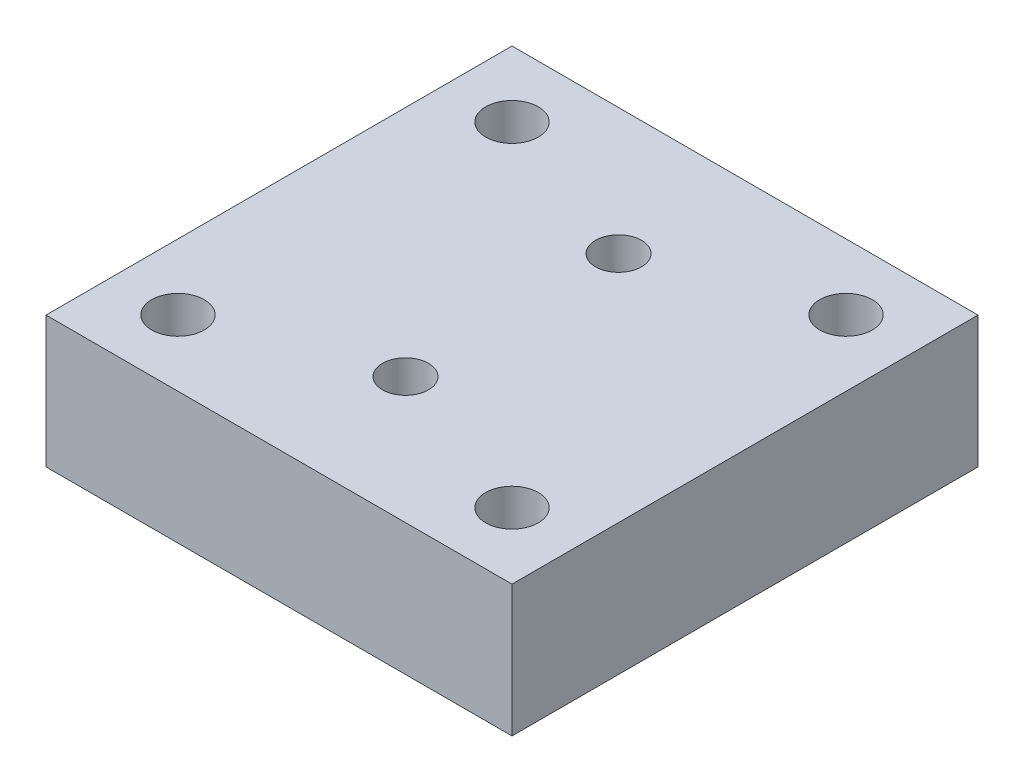
ISO-10303-21;
HEADER;
FILE_DESCRIPTION(('STEP AP214'),'2;1');
FILE_NAME('part.step','',(''),(''),'','','');
FILE_SCHEMA(('AUTOMOTIVE_DESIGN { 1 0 10303 214 1 1 1 1 }'));
ENDSEC;
DATA;
#1=APPLICATION_CONTEXT('core data for automotive mechanical design processes');
#2=APPLICATION_PROTOCOL_DEFINITION('international standard','automotive_design',2000,#1);
#3=PRODUCT_CONTEXT('',#1,'mechanical');
#4=PRODUCT('Part','Part','',(#3));
#5=PRODUCT_RELATED_PRODUCT_CATEGORY('part','',(#4));
#6=PRODUCT_DEFINITION_FORMATION('','',#4);
#7=PRODUCT_DEFINITION_CONTEXT('part definition',#1,'design');
#8=PRODUCT_DEFINITION('design','',#6,#7);
#9=PRODUCT_DEFINITION_SHAPE('','',#8);
#10=(LENGTH_UNIT() NAMED_UNIT(*) SI_UNIT(.MILLI.,.METRE.));
#11=(NAMED_UNIT(*) PLANE_ANGLE_UNIT() SI_UNIT($,.RADIAN.));
#12=(NAMED_UNIT(*) SI_UNIT($,.STERADIAN.) SOLID_ANGLE_UNIT());
#13=UNCERTAINTY_MEASURE_WITH_UNIT(LENGTH_MEASURE(1.E-05),#10,'distance_accuracy_value','');
#14=(GEOMETRIC_REPRESENTATION_CONTEXT(3) GLOBAL_UNCERTAINTY_ASSIGNED_CONTEXT((#13)) GLOBAL_UNIT_ASSIGNED_CONTEXT((#10,
#11,#12)) REPRESENTATION_CONTEXT('',''));
#15=CARTESIAN_POINT('',(0.,0.,0.));
#16=DIRECTION('',(0.,0.,1.));
#17=DIRECTION('',(1.,0.,0.));
#18=AXIS2_PLACEMENT_3D('',#15,#16,#17);
#19=CARTESIAN_POINT('',(0.,0.,20.574));
#20=DIRECTION('',(0.,1.,0.));
#21=DIRECTION('',(0.,0.,1.));
#22=AXIS2_PLACEMENT_3D('',#19,#20,#21);
#23=CYLINDRICAL_SURFACE('',#22,4.445);
#24=CARTESIAN_POINT('',(0.,25.4,20.574));
#25=DIRECTION('',(0.,1.,0.));
#26=DIRECTION('',(0.,0.,1.));
#27=AXIS2_PLACEMENT_3D('',#24,#25,#26);
#28=CIRCLE('',#27,4.445);
#29=CARTESIAN_POINT('',(0.,25.4,25.019));
#30=VERTEX_POINT('',#29);
#31=EDGE_CURVE('E130',#30,#30,#28,.T.);
#32=ORIENTED_EDGE('',*,*,#31,.T.);
#33=EDGE_LOOP('',(#32));
#34=FACE_BOUND('',#33,.T.);
#35=CARTESIAN_POINT('',(0.,7.62,20.574));
#36=DIRECTION('',(0.,-1.,0.));
#37=DIRECTION('',(0.,0.,-1.));
#38=AXIS2_PLACEMENT_3D('',#35,#36,#37);
#39=CIRCLE('',#38,4.445);
#40=CARTESIAN_POINT('',(0.,7.62,16.129));
#41=VERTEX_POINT('',#40);
#42=EDGE_CURVE('E37',#41,#41,#39,.F.);
#43=ORIENTED_EDGE('',*,*,#42,.F.);
#44=EDGE_LOOP('',(#43));
#45=FACE_BOUND('',#44,.T.);
#46=ADVANCED_FACE('F33',(#34,#45),#23,.F.);
#47=CARTESIAN_POINT('',(0.,0.,-20.574));
#48=DIRECTION('',(0.,1.,0.));
#49=DIRECTION('',(0.,0.,1.));
#50=AXIS2_PLACEMENT_3D('',#47,#48,#49);
#51=CYLINDRICAL_SURFACE('',#50,4.445);
#52=CARTESIAN_POINT('',(0.,25.4,-20.574));
#53=DIRECTION('',(0.,1.,0.));
#54=DIRECTION('',(0.,0.,1.));
#55=AXIS2_PLACEMENT_3D('',#52,#53,#54);
#56=CIRCLE('',#55,4.445);
#57=CARTESIAN_POINT('',(0.,25.4,-16.129));
#58=VERTEX_POINT('',#57);
#59=EDGE_CURVE('E145',#58,#58,#56,.T.);
#60=ORIENTED_EDGE('',*,*,#59,.T.);
#61=EDGE_LOOP('',(#60));
#62=FACE_BOUND('',#61,.T.);
#63=CARTESIAN_POINT('',(0.,7.62,-20.574));
#64=DIRECTION('',(0.,-1.,0.));
#65=DIRECTION('',(0.,0.,-1.));
#66=AXIS2_PLACEMENT_3D('',#63,#64,#65);
#67=CIRCLE('',#66,4.445);
#68=CARTESIAN_POINT('',(0.,7.62,-25.019));
#69=VERTEX_POINT('',#68);
#70=EDGE_CURVE('E124',#69,#69,#67,.F.);
#71=ORIENTED_EDGE('',*,*,#70,.F.);
#72=EDGE_LOOP('',(#71));
#73=FACE_BOUND('',#72,.T.);
#74=ADVANCED_FACE('F178',(#62,#73),#51,.F.);
#75=CARTESIAN_POINT('',(32.216,-25.4,32.216));
#76=DIRECTION('',(0.,1.,0.));
#77=DIRECTION('',(0.,0.,1.));
#78=AXIS2_PLACEMENT_3D('',#75,#76,#77);
#79=CYLINDRICAL_SURFACE('',#78,5.08000000000001);
#80=CARTESIAN_POINT('',(32.216,25.4,32.216));
#81=DIRECTION('',(0.,1.,0.));
#82=DIRECTION('',(0.,0.,1.));
#83=AXIS2_PLACEMENT_3D('',#80,#81,#82);
#84=CIRCLE('',#83,5.08000000000001);
#85=CARTESIAN_POINT('',(32.216,25.4,37.296));
#86=VERTEX_POINT('',#85);
#87=EDGE_CURVE('E43',#86,#86,#84,.T.);
#88=ORIENTED_EDGE('',*,*,#87,.T.);
#89=EDGE_LOOP('',(#88));
#90=FACE_BOUND('',#89,.T.);
#91=CARTESIAN_POINT('',(32.216,0.,32.216));
#92=DIRECTION('',(0.,1.,0.));
#93=DIRECTION('',(0.,0.,1.));
#94=AXIS2_PLACEMENT_3D('',#91,#92,#93);
#95=CIRCLE('',#94,5.08000000000001);
#96=CARTESIAN_POINT('',(32.216,0.,37.296));
#97=VERTEX_POINT('',#96);
#98=EDGE_CURVE('E11',#97,#97,#95,.T.);
#99=ORIENTED_EDGE('',*,*,#98,.F.);
#100=EDGE_LOOP('',(#99));
#101=FACE_BOUND('',#100,.T.);
#102=ADVANCED_FACE('F35',(#90,#101),#79,.F.);
#103=CARTESIAN_POINT('',(-32.3,-25.4,32.216));
#104=DIRECTION('',(0.,1.,0.));
#105=DIRECTION('',(0.,0.,1.));
#106=AXIS2_PLACEMENT_3D('',#103,#104,#105);
#107=CYLINDRICAL_SURFACE('',#106,5.08000000000001);
#108=CARTESIAN_POINT('',(-32.3,25.4,32.216));
#109=DIRECTION('',(0.,1.,0.));
#110=DIRECTION('',(0.,0.,1.));
#111=AXIS2_PLACEMENT_3D('',#108,#109,#110);
#112=CIRCLE('',#111,5.08000000000001);
#113=CARTESIAN_POINT('',(-32.3,25.4,37.296));
#114=VERTEX_POINT('',#113);
#115=EDGE_CURVE('E114',#114,#114,#112,.T.);
#116=ORIENTED_EDGE('',*,*,#115,.T.);
#117=EDGE_LOOP('',(#116));
#118=FACE_BOUND('',#117,.T.);
#119=CARTESIAN_POINT('',(-32.3,0.,32.216));
#120=DIRECTION('',(0.,1.,0.));
#121=DIRECTION('',(0.,0.,1.));
#122=AXIS2_PLACEMENT_3D('',#119,#120,#121);
#123=CIRCLE('',#122,5.08000000000001);
#124=CARTESIAN_POINT('',(-32.3,0.,37.296));
#125=VERTEX_POINT('',#124);
#126=EDGE_CURVE('E120',#125,#125,#123,.T.);
#127=ORIENTED_EDGE('',*,*,#126,.F.);
#128=EDGE_LOOP('',(#127));
#129=FACE_BOUND('',#128,.T.);
#130=ADVANCED_FACE('F256',(#118,#129),#107,.F.);
#131=CARTESIAN_POINT('',(45.,25.4,-45.));
#132=DIRECTION('',(-1.,0.,0.));
#133=DIRECTION('',(0.,0.,1.));
#134=AXIS2_PLACEMENT_3D('',#131,#132,#133);
#135=PLANE('',#134);
#136=DIRECTION('',(0.,0.,-1.));
#137=VECTOR('',#136,1.);
#138=CARTESIAN_POINT('',(45.,0.,-45.));
#139=LINE('',#138,#137);
#140=CARTESIAN_POINT('',(45.,0.,45.));
#141=VERTEX_POINT('',#140);
#142=CARTESIAN_POINT('',(45.,0.,-45.));
#143=VERTEX_POINT('',#142);
#144=EDGE_CURVE('E104',#141,#143,#139,.T.);
#145=ORIENTED_EDGE('',*,*,#144,.T.);
#146=DIRECTION('',(0.,-1.,0.));
#147=VECTOR('',#146,1.);
#148=CARTESIAN_POINT('',(45.,25.4,-45.));
#149=LINE('',#148,#147);
#150=CARTESIAN_POINT('',(45.,25.4,-45.));
#151=VERTEX_POINT('',#150);
#152=EDGE_CURVE('E95',#151,#143,#149,.T.);
#153=ORIENTED_EDGE('',*,*,#152,.F.);
#154=DIRECTION('',(0.,0.,-1.));
#155=VECTOR('',#154,1.);
#156=CARTESIAN_POINT('',(45.,25.4,-45.));
#157=LINE('',#156,#155);
#158=CARTESIAN_POINT('',(45.,25.4,45.));
#159=VERTEX_POINT('',#158);
#160=EDGE_CURVE('E89',#159,#151,#157,.T.);
#161=ORIENTED_EDGE('',*,*,#160,.F.);
#162=DIRECTION('',(0.,-1.,0.));
#163=VECTOR('',#162,1.);
#164=CARTESIAN_POINT('',(45.,25.4,45.));
#165=LINE('',#164,#163);
#166=EDGE_CURVE('E100',#159,#141,#165,.T.);
#167=ORIENTED_EDGE('',*,*,#166,.T.);
#168=EDGE_LOOP('',(#145,#153,#161,#167));
#169=FACE_BOUND('',#168,.T.);
#170=ADVANCED_FACE('F261',(#169),#135,.F.);
#171=CARTESIAN_POINT('',(-45.,25.4,-45.));
#172=DIRECTION('',(0.,0.,1.));
#173=DIRECTION('',(1.,0.,0.));
#174=AXIS2_PLACEMENT_3D('',#171,#172,#173);
#175=PLANE('',#174);
#176=DIRECTION('',(-1.,0.,0.));
#177=VECTOR('',#176,1.);
#178=CARTESIAN_POINT('',(-45.,0.,-45.));
#179=LINE('',#178,#177);
#180=CARTESIAN_POINT('',(-45.,0.,-45.));
#181=VERTEX_POINT('',#180);
#182=EDGE_CURVE('E94',#143,#181,#179,.T.);
#183=ORIENTED_EDGE('',*,*,#182,.T.);
#184=DIRECTION('',(0.,-1.,0.));
#185=VECTOR('',#184,1.);
#186=CARTESIAN_POINT('',(-45.,25.4,-45.));
#187=LINE('',#186,#185);
#188=CARTESIAN_POINT('',(-45.,25.4,-45.));
#189=VERTEX_POINT('',#188);
#190=EDGE_CURVE('E92',#189,#181,#187,.T.);
#191=ORIENTED_EDGE('',*,*,#190,.F.);
#192=DIRECTION('',(-1.,0.,0.));
#193=VECTOR('',#192,1.);
#194=CARTESIAN_POINT('',(-45.,25.4,-45.));
#195=LINE('',#194,#193);
#196=EDGE_CURVE('E83',#151,#189,#195,.T.);
#197=ORIENTED_EDGE('',*,*,#196,.F.);
#198=ORIENTED_EDGE('',*,*,#152,.T.);
#199=EDGE_LOOP('',(#183,#191,#197,#198));
#200=FACE_BOUND('',#199,.T.);
#201=ADVANCED_FACE('F93',(#200),#175,.F.);
#202=CARTESIAN_POINT('',(-45.,25.4,-45.));
#203=DIRECTION('',(1.,0.,0.));
#204=DIRECTION('',(0.,0.,-1.));
#205=AXIS2_PLACEMENT_3D('',#202,#203,#204);
#206=PLANE('',#205);
#207=DIRECTION('',(0.,0.,1.));
#208=VECTOR('',#207,1.);
#209=CARTESIAN_POINT('',(-45.,0.,-45.));
#210=LINE('',#209,#208);
#211=CARTESIAN_POINT('',(-45.,0.,45.));
#212=VERTEX_POINT('',#211);
#213=EDGE_CURVE('E69',#181,#212,#210,.T.);
#214=ORIENTED_EDGE('',*,*,#213,.T.);
#215=DIRECTION('',(0.,-1.,0.));
#216=VECTOR('',#215,1.);
#217=CARTESIAN_POINT('',(-45.,25.4,45.));
#218=LINE('',#217,#216);
#219=CARTESIAN_POINT('',(-45.,25.4,45.));
#220=VERTEX_POINT('',#219);
#221=EDGE_CURVE('E96',#220,#212,#218,.T.);
#222=ORIENTED_EDGE('',*,*,#221,.F.);
#223=DIRECTION('',(0.,0.,1.));
#224=VECTOR('',#223,1.);
#225=CARTESIAN_POINT('',(-45.,25.4,-45.));
#226=LINE('',#225,#224);
#227=EDGE_CURVE('E87',#189,#220,#226,.T.);
#228=ORIENTED_EDGE('',*,*,#227,.F.);
#229=ORIENTED_EDGE('',*,*,#190,.T.);
#230=EDGE_LOOP('',(#214,#222,#228,#229));
#231=FACE_BOUND('',#230,.T.);
#232=ADVANCED_FACE('F98',(#231),#206,.F.);
#233=CARTESIAN_POINT('',(-45.,25.4,45.));
#234=DIRECTION('',(0.,0.,-1.));
#235=DIRECTION('',(-1.,0.,0.));
#236=AXIS2_PLACEMENT_3D('',#233,#234,#235);
#237=PLANE('',#236);
#238=DIRECTION('',(1.,0.,0.));
#239=VECTOR('',#238,1.);
#240=CARTESIAN_POINT('',(-45.,0.,45.));
#241=LINE('',#240,#239);
#242=EDGE_CURVE('E75',#212,#141,#241,.T.);
#243=ORIENTED_EDGE('',*,*,#242,.T.);
#244=ORIENTED_EDGE('',*,*,#166,.F.);
#245=DIRECTION('',(1.,0.,0.));
#246=VECTOR('',#245,1.);
#247=CARTESIAN_POINT('',(-45.,25.4,45.));
#248=LINE('',#247,#246);
#249=EDGE_CURVE('E52',#220,#159,#248,.T.);
#250=ORIENTED_EDGE('',*,*,#249,.F.);
#251=ORIENTED_EDGE('',*,*,#221,.T.);
#252=EDGE_LOOP('',(#243,#244,#250,#251));
#253=FACE_BOUND('',#252,.T.);
#254=ADVANCED_FACE('F164',(#253),#237,.F.);
#255=CARTESIAN_POINT('',(0.,25.4,0.));
#256=DIRECTION('',(0.,1.,0.));
#257=DIRECTION('',(0.,0.,1.));
#258=AXIS2_PLACEMENT_3D('',#255,#256,#257);
#259=PLANE('',#258);
#260=ORIENTED_EDGE('',*,*,#59,.F.);
#261=EDGE_LOOP('',(#260));
#262=FACE_BOUND('',#261,.T.);
#263=ORIENTED_EDGE('',*,*,#31,.F.);
#264=EDGE_LOOP('',(#263));
#265=FACE_BOUND('',#264,.T.);
#266=CARTESIAN_POINT('',(32.216,25.4,-32.3));
#267=DIRECTION('',(0.,1.,0.));
#268=DIRECTION('',(0.,0.,1.));
#269=AXIS2_PLACEMENT_3D('',#266,#267,#268);
#270=CIRCLE('',#269,5.08000000000001);
#271=CARTESIAN_POINT('',(32.216,25.4,-27.22));
#272=VERTEX_POINT('',#271);
#273=EDGE_CURVE('E148',#272,#272,#270,.T.);
#274=ORIENTED_EDGE('',*,*,#273,.F.);
#275=EDGE_LOOP('',(#274));
#276=FACE_BOUND('',#275,.T.);
#277=CARTESIAN_POINT('',(-32.3,25.4,-32.3));
#278=DIRECTION('',(0.,1.,0.));
#279=DIRECTION('',(0.,0.,1.));
#280=AXIS2_PLACEMENT_3D('',#277,#278,#279);
#281=CIRCLE('',#280,5.08000000000001);
#282=CARTESIAN_POINT('',(-32.3,25.4,-27.22));
#283=VERTEX_POINT('',#282);
#284=EDGE_CURVE('E117',#283,#283,#281,.T.);
#285=ORIENTED_EDGE('',*,*,#284,.F.);
#286=EDGE_LOOP('',(#285));
#287=FACE_BOUND('',#286,.T.);
#288=ORIENTED_EDGE('',*,*,#160,.T.);
#289=ORIENTED_EDGE('',*,*,#196,.T.);
#290=ORIENTED_EDGE('',*,*,#227,.T.);
#291=ORIENTED_EDGE('',*,*,#249,.T.);
#292=EDGE_LOOP('',(#288,#289,#290,#291));
#293=FACE_BOUND('',#292,.T.);
#294=ORIENTED_EDGE('',*,*,#115,.F.);
#295=EDGE_LOOP('',(#294));
#296=FACE_BOUND('',#295,.T.);
#297=ORIENTED_EDGE('',*,*,#87,.F.);
#298=EDGE_LOOP('',(#297));
#299=FACE_BOUND('',#298,.T.);
#300=ADVANCED_FACE('F84',(#262,#265,#276,#287,#293,#296,#299),#259,.T.);
#301=CARTESIAN_POINT('',(0.,0.,0.));
#302=DIRECTION('',(0.,1.,0.));
#303=DIRECTION('',(0.,0.,1.));
#304=AXIS2_PLACEMENT_3D('',#301,#302,#303);
#305=PLANE('',#304);
#306=CARTESIAN_POINT('',(0.,0.,-20.574));
#307=DIRECTION('',(0.,-1.,0.));
#308=DIRECTION('',(0.,0.,-1.));
#309=AXIS2_PLACEMENT_3D('',#306,#307,#308);
#310=CIRCLE('',#309,8.89);
#311=CARTESIAN_POINT('',(0.,0.,-29.464));
#312=VERTEX_POINT('',#311);
#313=EDGE_CURVE('E132',#312,#312,#310,.T.);
#314=ORIENTED_EDGE('',*,*,#313,.F.);
#315=EDGE_LOOP('',(#314));
#316=FACE_BOUND('',#315,.T.);
#317=CARTESIAN_POINT('',(0.,0.,20.574));
#318=DIRECTION('',(0.,-1.,0.));
#319=DIRECTION('',(0.,0.,-1.));
#320=AXIS2_PLACEMENT_3D('',#317,#318,#319);
#321=CIRCLE('',#320,8.89);
#322=CARTESIAN_POINT('',(0.,0.,11.684));
#323=VERTEX_POINT('',#322);
#324=EDGE_CURVE('E142',#323,#323,#321,.T.);
#325=ORIENTED_EDGE('',*,*,#324,.F.);
#326=EDGE_LOOP('',(#325));
#327=FACE_BOUND('',#326,.T.);
#328=CARTESIAN_POINT('',(32.216,0.,-32.3));
#329=DIRECTION('',(0.,1.,0.));
#330=DIRECTION('',(0.,0.,1.));
#331=AXIS2_PLACEMENT_3D('',#328,#329,#330);
#332=CIRCLE('',#331,5.08000000000001);
#333=CARTESIAN_POINT('',(32.216,0.,-27.22));
#334=VERTEX_POINT('',#333);
#335=EDGE_CURVE('E153',#334,#334,#332,.T.);
#336=ORIENTED_EDGE('',*,*,#335,.T.);
#337=EDGE_LOOP('',(#336));
#338=FACE_BOUND('',#337,.T.);
#339=CARTESIAN_POINT('',(-32.3,0.,-32.3));
#340=DIRECTION('',(0.,1.,0.));
#341=DIRECTION('',(0.,0.,1.));
#342=AXIS2_PLACEMENT_3D('',#339,#340,#341);
#343=CIRCLE('',#342,5.08000000000001);
#344=CARTESIAN_POINT('',(-32.3,0.,-27.22));
#345=VERTEX_POINT('',#344);
#346=EDGE_CURVE('E107',#345,#345,#343,.T.);
#347=ORIENTED_EDGE('',*,*,#346,.T.);
#348=EDGE_LOOP('',(#347));
#349=FACE_BOUND('',#348,.T.);
#350=ORIENTED_EDGE('',*,*,#144,.F.);
#351=ORIENTED_EDGE('',*,*,#242,.F.);
#352=ORIENTED_EDGE('',*,*,#213,.F.);
#353=ORIENTED_EDGE('',*,*,#182,.F.);
#354=EDGE_LOOP('',(#350,#351,#352,#353));
#355=FACE_BOUND('',#354,.T.);
#356=ORIENTED_EDGE('',*,*,#126,.T.);
#357=EDGE_LOOP('',(#356));
#358=FACE_BOUND('',#357,.T.);
#359=ORIENTED_EDGE('',*,*,#98,.T.);
#360=EDGE_LOOP('',(#359));
#361=FACE_BOUND('',#360,.T.);
#362=ADVANCED_FACE('F163',(#316,#327,#338,#349,#355,#358,#361),#305,.F.);
#363=CARTESIAN_POINT('',(-32.3,-25.4,-32.3));
#364=DIRECTION('',(0.,1.,0.));
#365=DIRECTION('',(0.,0.,1.));
#366=AXIS2_PLACEMENT_3D('',#363,#364,#365);
#367=CYLINDRICAL_SURFACE('',#366,5.08000000000001);
#368=ORIENTED_EDGE('',*,*,#284,.T.);
#369=EDGE_LOOP('',(#368));
#370=FACE_BOUND('',#369,.T.);
#371=ORIENTED_EDGE('',*,*,#346,.F.);
#372=EDGE_LOOP('',(#371));
#373=FACE_BOUND('',#372,.T.);
#374=ADVANCED_FACE('F159',(#370,#373),#367,.F.);
#375=CARTESIAN_POINT('',(32.216,-25.4,-32.3));
#376=DIRECTION('',(0.,1.,0.));
#377=DIRECTION('',(0.,0.,1.));
#378=AXIS2_PLACEMENT_3D('',#375,#376,#377);
#379=CYLINDRICAL_SURFACE('',#378,5.08000000000001);
#380=ORIENTED_EDGE('',*,*,#273,.T.);
#381=EDGE_LOOP('',(#380));
#382=FACE_BOUND('',#381,.T.);
#383=ORIENTED_EDGE('',*,*,#335,.F.);
#384=EDGE_LOOP('',(#383));
#385=FACE_BOUND('',#384,.T.);
#386=ADVANCED_FACE('F189',(#382,#385),#379,.F.);
#387=CARTESIAN_POINT('',(0.,7.62,-20.574));
#388=DIRECTION('',(0.,-1.,0.));
#389=DIRECTION('',(0.,0.,-1.));
#390=AXIS2_PLACEMENT_3D('',#387,#388,#389);
#391=PLANE('',#390);
#392=CARTESIAN_POINT('',(0.,7.62,-20.574));
#393=DIRECTION('',(0.,-1.,0.));
#394=DIRECTION('',(0.,0.,-1.));
#395=AXIS2_PLACEMENT_3D('',#392,#393,#394);
#396=CIRCLE('',#395,8.89);
#397=CARTESIAN_POINT('',(0.,7.62,-29.464));
#398=VERTEX_POINT('',#397);
#399=EDGE_CURVE('E126',#398,#398,#396,.T.);
#400=ORIENTED_EDGE('',*,*,#399,.T.);
#401=EDGE_LOOP('',(#400));
#402=FACE_BOUND('',#401,.T.);
#403=ORIENTED_EDGE('',*,*,#70,.T.);
#404=EDGE_LOOP('',(#403));
#405=FACE_BOUND('',#404,.T.);
#406=ADVANCED_FACE('F191',(#402,#405),#391,.T.);
#407=CARTESIAN_POINT('',(0.,7.62,-20.574));
#408=DIRECTION('',(0.,-1.,0.));
#409=DIRECTION('',(0.,0.,-1.));
#410=AXIS2_PLACEMENT_3D('',#407,#408,#409);
#411=CYLINDRICAL_SURFACE('',#410,8.89);
#412=ORIENTED_EDGE('',*,*,#399,.F.);
#413=EDGE_LOOP('',(#412));
#414=FACE_BOUND('',#413,.T.);
#415=ORIENTED_EDGE('',*,*,#313,.T.);
#416=EDGE_LOOP('',(#415));
#417=FACE_BOUND('',#416,.T.);
#418=ADVANCED_FACE('F211',(#414,#417),#411,.F.);
#419=CARTESIAN_POINT('',(0.,7.62,20.574));
#420=DIRECTION('',(0.,-1.,0.));
#421=DIRECTION('',(0.,0.,-1.));
#422=AXIS2_PLACEMENT_3D('',#419,#420,#421);
#423=PLANE('',#422);
#424=CARTESIAN_POINT('',(0.,7.62,20.574));
#425=DIRECTION('',(0.,-1.,0.));
#426=DIRECTION('',(0.,0.,-1.));
#427=AXIS2_PLACEMENT_3D('',#424,#425,#426);
#428=CIRCLE('',#427,8.89);
#429=CARTESIAN_POINT('',(0.,7.62,11.684));
#430=VERTEX_POINT('',#429);
#431=EDGE_CURVE('E137',#430,#430,#428,.T.);
#432=ORIENTED_EDGE('',*,*,#431,.T.);
#433=EDGE_LOOP('',(#432));
#434=FACE_BOUND('',#433,.T.);
#435=ORIENTED_EDGE('',*,*,#42,.T.);
#436=EDGE_LOOP('',(#435));
#437=FACE_BOUND('',#436,.T.);
#438=ADVANCED_FACE('F218',(#434,#437),#423,.T.);
#439=CARTESIAN_POINT('',(0.,7.62,20.574));
#440=DIRECTION('',(0.,-1.,0.));
#441=DIRECTION('',(0.,0.,-1.));
#442=AXIS2_PLACEMENT_3D('',#439,#440,#441);
#443=CYLINDRICAL_SURFACE('',#442,8.89);
#444=ORIENTED_EDGE('',*,*,#431,.F.);
#445=EDGE_LOOP('',(#444));
#446=FACE_BOUND('',#445,.T.);
#447=ORIENTED_EDGE('',*,*,#324,.T.);
#448=EDGE_LOOP('',(#447));
#449=FACE_BOUND('',#448,.T.);
#450=ADVANCED_FACE('F226',(#446,#449),#443,.F.);
#451=CLOSED_SHELL('',(#46,#74,#102,#130,#170,#201,#232,#254,#300,#362,#374,#386,#406,#418,#438,#450));
#452=MANIFOLD_SOLID_BREP('B2',#451);
#453=ADVANCED_BREP_SHAPE_REPRESENTATION('',(#18,#452),#14);
#454=SHAPE_DEFINITION_REPRESENTATION(#9,#453);
ENDSEC;
END-ISO-10303-21;
